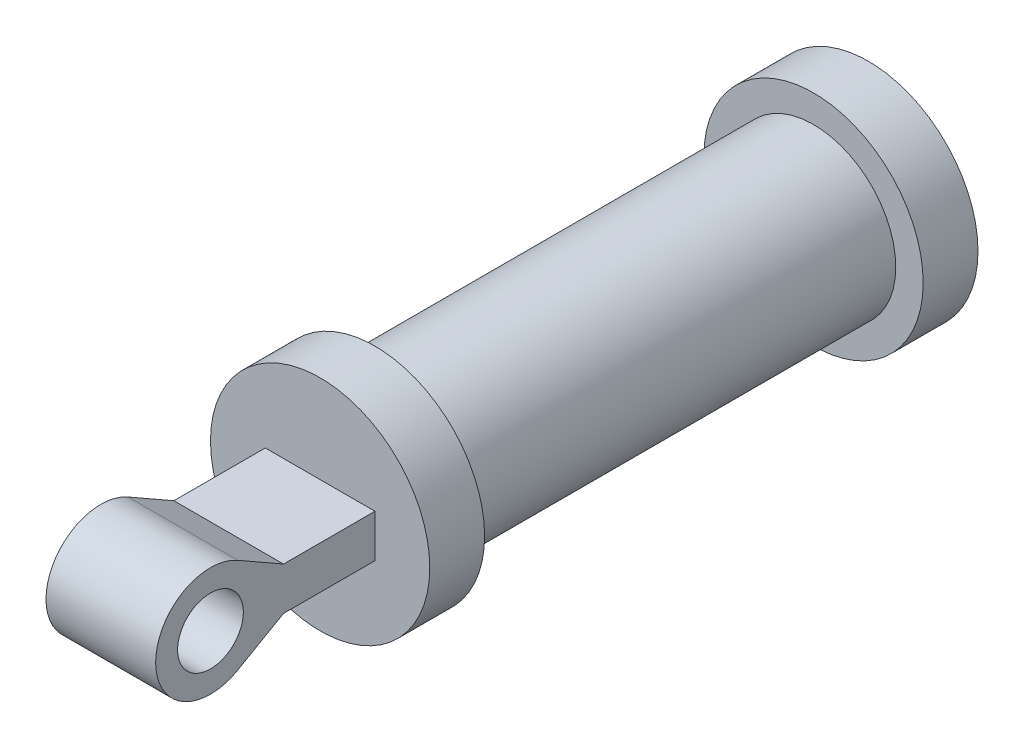
ISO-10303-21;
HEADER;
FILE_DESCRIPTION(('STEP AP214'),'2;1');
FILE_NAME('part.step','',(''),(''),'','','');
FILE_SCHEMA(('AUTOMOTIVE_DESIGN { 1 0 10303 214 1 1 1 1 }'));
ENDSEC;
DATA;
#1=APPLICATION_CONTEXT('core data for automotive mechanical design processes');
#2=APPLICATION_PROTOCOL_DEFINITION('international standard','automotive_design',2000,#1);
#3=PRODUCT_CONTEXT('',#1,'mechanical');
#4=PRODUCT('Part','Part','',(#3));
#5=PRODUCT_RELATED_PRODUCT_CATEGORY('part','',(#4));
#6=PRODUCT_DEFINITION_FORMATION('','',#4);
#7=PRODUCT_DEFINITION_CONTEXT('part definition',#1,'design');
#8=PRODUCT_DEFINITION('design','',#6,#7);
#9=PRODUCT_DEFINITION_SHAPE('','',#8);
#10=(LENGTH_UNIT() NAMED_UNIT(*) SI_UNIT(.MILLI.,.METRE.));
#11=(NAMED_UNIT(*) PLANE_ANGLE_UNIT() SI_UNIT($,.RADIAN.));
#12=(NAMED_UNIT(*) SI_UNIT($,.STERADIAN.) SOLID_ANGLE_UNIT());
#13=UNCERTAINTY_MEASURE_WITH_UNIT(LENGTH_MEASURE(1.E-05),#10,'distance_accuracy_value','');
#14=(GEOMETRIC_REPRESENTATION_CONTEXT(3) GLOBAL_UNCERTAINTY_ASSIGNED_CONTEXT((#13)) GLOBAL_UNIT_ASSIGNED_CONTEXT((#10,
#11,#12)) REPRESENTATION_CONTEXT('',''));
#15=CARTESIAN_POINT('',(0.,0.,0.));
#16=DIRECTION('',(0.,0.,1.));
#17=DIRECTION('',(1.,0.,0.));
#18=AXIS2_PLACEMENT_3D('',#15,#16,#17);
#19=CARTESIAN_POINT('',(-100.,-236.576375585564,-127.131491420684));
#20=DIRECTION('',(0.,0.86825917602219,-0.496110877983205));
#21=DIRECTION('',(0.,0.496110877983205,0.86825917602219));
#22=AXIS2_PLACEMENT_3D('',#19,#20,#21);
#23=PLANE('',#22);
#24=DIRECTION('',(1.,0.,0.));
#25=VECTOR('',#24,1.);
#26=CARTESIAN_POINT('',(-100.,43.4129588011095,362.886606464693));
#27=LINE('',#26,#25);
#28=CARTESIAN_POINT('',(-50.,43.4129588011095,362.886606464693));
#29=VERTEX_POINT('',#28);
#30=CARTESIAN_POINT('',(50.,43.4129588011095,362.886606464693));
#31=VERTEX_POINT('',#30);
#32=EDGE_CURVE('E150',#29,#31,#27,.T.);
#33=ORIENTED_EDGE('',*,*,#32,.T.);
#34=DIRECTION('',(0.,-0.496110877983205,-0.86825917602219));
#35=VECTOR('',#34,1.);
#36=CARTESIAN_POINT('',(50.,-236.576375585564,-127.131491420684));
#37=LINE('',#36,#35);
#38=CARTESIAN_POINT('',(50.,19.5216947713146,321.073757480275));
#39=VERTEX_POINT('',#38);
#40=EDGE_CURVE('E90',#31,#39,#37,.T.);
#41=ORIENTED_EDGE('',*,*,#40,.T.);
#42=DIRECTION('',(1.,0.,0.));
#43=VECTOR('',#42,1.);
#44=CARTESIAN_POINT('',(-100.,19.5216947713145,321.073757480275));
#45=LINE('',#44,#43);
#46=CARTESIAN_POINT('',(-50.,19.5216947713145,321.073757480275));
#47=VERTEX_POINT('',#46);
#48=EDGE_CURVE('E133',#47,#39,#45,.T.);
#49=ORIENTED_EDGE('',*,*,#48,.F.);
#50=DIRECTION('',(0.,-0.496110877983205,-0.86825917602219));
#51=VECTOR('',#50,1.);
#52=CARTESIAN_POINT('',(-50.,-236.576375585564,-127.131491420684));
#53=LINE('',#52,#51);
#54=EDGE_CURVE('E141',#29,#47,#53,.T.);
#55=ORIENTED_EDGE('',*,*,#54,.F.);
#56=EDGE_LOOP('',(#33,#41,#49,#55));
#57=FACE_BOUND('',#56,.T.);
#58=ADVANCED_FACE('F73',(#57),#23,.T.);
#59=CARTESIAN_POINT('',(-100.,0.,387.692150363853));
#60=DIRECTION('',(1.,0.,0.));
#61=DIRECTION('',(0.,0.,-1.));
#62=AXIS2_PLACEMENT_3D('',#59,#60,#61);
#63=CYLINDRICAL_SURFACE('',#62,50.);
#64=DIRECTION('',(1.,0.,0.));
#65=VECTOR('',#64,1.);
#66=CARTESIAN_POINT('',(-100.,-43.4129588011095,362.886606464692));
#67=LINE('',#66,#65);
#68=CARTESIAN_POINT('',(-50.,-43.4129588011095,362.886606464692));
#69=VERTEX_POINT('',#68);
#70=CARTESIAN_POINT('',(50.,-43.4129588011095,362.886606464692));
#71=VERTEX_POINT('',#70);
#72=EDGE_CURVE('E154',#69,#71,#67,.T.);
#73=ORIENTED_EDGE('',*,*,#72,.T.);
#74=CARTESIAN_POINT('',(50.,0.,387.692150363853));
#75=DIRECTION('',(1.,0.,0.));
#76=DIRECTION('',(0.,0.,-1.));
#77=AXIS2_PLACEMENT_3D('',#74,#75,#76);
#78=CIRCLE('',#77,50.);
#79=EDGE_CURVE('E94',#71,#31,#78,.F.);
#80=ORIENTED_EDGE('',*,*,#79,.T.);
#81=ORIENTED_EDGE('',*,*,#32,.F.);
#82=CARTESIAN_POINT('',(-50.,0.,387.692150363853));
#83=DIRECTION('',(1.,0.,0.));
#84=DIRECTION('',(0.,0.,-1.));
#85=AXIS2_PLACEMENT_3D('',#82,#83,#84);
#86=CIRCLE('',#85,50.);
#87=EDGE_CURVE('E145',#69,#29,#86,.F.);
#88=ORIENTED_EDGE('',*,*,#87,.F.);
#89=EDGE_LOOP('',(#73,#80,#81,#88));
#90=FACE_BOUND('',#89,.T.);
#91=ADVANCED_FACE('F233',(#90),#63,.T.);
#92=CARTESIAN_POINT('',(-100.,236.576375585563,-127.131491420684));
#93=DIRECTION('',(0.,0.868259176022191,0.496110877983205));
#94=DIRECTION('',(0.,-0.496110877983205,0.868259176022191));
#95=AXIS2_PLACEMENT_3D('',#92,#93,#94);
#96=PLANE('',#95);
#97=DIRECTION('',(0.,0.496110877983205,-0.868259176022191));
#98=VECTOR('',#97,1.);
#99=CARTESIAN_POINT('',(50.,236.576375585563,-127.131491420684));
#100=LINE('',#99,#98);
#101=CARTESIAN_POINT('',(50.,-19.5216947713145,321.073757480275));
#102=VERTEX_POINT('',#101);
#103=EDGE_CURVE('E209',#71,#102,#100,.T.);
#104=ORIENTED_EDGE('',*,*,#103,.F.);
#105=ORIENTED_EDGE('',*,*,#72,.F.);
#106=DIRECTION('',(0.,0.496110877983205,-0.868259176022191));
#107=VECTOR('',#106,1.);
#108=CARTESIAN_POINT('',(-50.,236.576375585563,-127.131491420684));
#109=LINE('',#108,#107);
#110=CARTESIAN_POINT('',(-50.,-19.5216947713145,321.073757480275));
#111=VERTEX_POINT('',#110);
#112=EDGE_CURVE('E193',#69,#111,#109,.T.);
#113=ORIENTED_EDGE('',*,*,#112,.T.);
#114=DIRECTION('',(1.,0.,0.));
#115=VECTOR('',#114,1.);
#116=CARTESIAN_POINT('',(-100.,-19.5216947713145,321.073757480275));
#117=LINE('',#116,#115);
#118=EDGE_CURVE('E216',#111,#102,#117,.T.);
#119=ORIENTED_EDGE('',*,*,#118,.T.);
#120=EDGE_LOOP('',(#104,#105,#113,#119));
#121=FACE_BOUND('',#120,.T.);
#122=ADVANCED_FACE('F231',(#121),#96,.F.);
#123=CARTESIAN_POINT('',(0.,0.,-212.307849636147));
#124=DIRECTION('',(0.,0.,-1.));
#125=DIRECTION('',(-1.,0.,0.));
#126=AXIS2_PLACEMENT_3D('',#123,#124,#125);
#127=CYLINDRICAL_SURFACE('',#126,100.);
#128=CARTESIAN_POINT('',(0.,0.,-212.307849636147));
#129=DIRECTION('',(0.,0.,1.));
#130=DIRECTION('',(1.,0.,0.));
#131=AXIS2_PLACEMENT_3D('',#128,#129,#130);
#132=CIRCLE('',#131,100.);
#133=CARTESIAN_POINT('',(100.,0.,-212.307849636147));
#134=VERTEX_POINT('',#133);
#135=EDGE_CURVE('E82',#134,#134,#132,.T.);
#136=ORIENTED_EDGE('',*,*,#135,.F.);
#137=EDGE_LOOP('',(#136));
#138=FACE_BOUND('',#137,.T.);
#139=CARTESIAN_POINT('',(0.,0.,-262.307849636147));
#140=DIRECTION('',(0.,0.,1.));
#141=DIRECTION('',(1.,0.,0.));
#142=AXIS2_PLACEMENT_3D('',#139,#140,#141);
#143=CIRCLE('',#142,100.);
#144=CARTESIAN_POINT('',(100.,0.,-262.307849636147));
#145=VERTEX_POINT('',#144);
#146=EDGE_CURVE('E187',#145,#145,#143,.T.);
#147=ORIENTED_EDGE('',*,*,#146,.T.);
#148=EDGE_LOOP('',(#147));
#149=FACE_BOUND('',#148,.T.);
#150=ADVANCED_FACE('F75',(#138,#149),#127,.T.);
#151=CARTESIAN_POINT('',(0.,0.,-212.307849636147));
#152=DIRECTION('',(0.,0.,1.));
#153=DIRECTION('',(1.,0.,0.));
#154=AXIS2_PLACEMENT_3D('',#151,#152,#153);
#155=PLANE('',#154);
#156=CARTESIAN_POINT('',(0.,0.,-212.307849636147));
#157=DIRECTION('',(0.,0.,1.));
#158=DIRECTION('',(1.,0.,0.));
#159=AXIS2_PLACEMENT_3D('',#156,#157,#158);
#160=CIRCLE('',#159,75.);
#161=CARTESIAN_POINT('',(75.,0.,-212.307849636147));
#162=VERTEX_POINT('',#161);
#163=EDGE_CURVE('E12',#162,#162,#160,.T.);
#164=ORIENTED_EDGE('',*,*,#163,.F.);
#165=EDGE_LOOP('',(#164));
#166=FACE_BOUND('',#165,.T.);
#167=ORIENTED_EDGE('',*,*,#135,.T.);
#168=EDGE_LOOP('',(#167));
#169=FACE_BOUND('',#168,.T.);
#170=ADVANCED_FACE('F284',(#166,#169),#155,.T.);
#171=CARTESIAN_POINT('',(0.,0.,-262.307849636147));
#172=DIRECTION('',(0.,0.,1.));
#173=DIRECTION('',(1.,0.,0.));
#174=AXIS2_PLACEMENT_3D('',#171,#172,#173);
#175=PLANE('',#174);
#176=CARTESIAN_POINT('',(0.,0.,-262.307849636147));
#177=DIRECTION('',(0.,0.,1.));
#178=DIRECTION('',(1.,0.,0.));
#179=AXIS2_PLACEMENT_3D('',#176,#177,#178);
#180=CIRCLE('',#179,24.);
#181=CARTESIAN_POINT('',(24.,0.,-262.307849636147));
#182=VERTEX_POINT('',#181);
#183=EDGE_CURVE('E184',#182,#182,#180,.T.);
#184=ORIENTED_EDGE('',*,*,#183,.T.);
#185=EDGE_LOOP('',(#184));
#186=FACE_BOUND('',#185,.T.);
#187=ORIENTED_EDGE('',*,*,#146,.F.);
#188=EDGE_LOOP('',(#187));
#189=FACE_BOUND('',#188,.T.);
#190=ADVANCED_FACE('F282',(#186,#189),#175,.F.);
#191=CARTESIAN_POINT('',(0.,0.,-212.307849636147));
#192=DIRECTION('',(0.,0.,1.));
#193=DIRECTION('',(1.,0.,0.));
#194=AXIS2_PLACEMENT_3D('',#191,#192,#193);
#195=CYLINDRICAL_SURFACE('',#194,24.);
#196=CARTESIAN_POINT('',(0.,0.,-238.307849636147));
#197=DIRECTION('',(0.,0.,1.));
#198=DIRECTION('',(1.,0.,0.));
#199=AXIS2_PLACEMENT_3D('',#196,#197,#198);
#200=CIRCLE('',#199,24.);
#201=CARTESIAN_POINT('',(24.,0.,-238.307849636147));
#202=VERTEX_POINT('',#201);
#203=EDGE_CURVE('E181',#202,#202,#200,.T.);
#204=ORIENTED_EDGE('',*,*,#203,.T.);
#205=EDGE_LOOP('',(#204));
#206=FACE_BOUND('',#205,.T.);
#207=ORIENTED_EDGE('',*,*,#183,.F.);
#208=EDGE_LOOP('',(#207));
#209=FACE_BOUND('',#208,.T.);
#210=ADVANCED_FACE('F278',(#206,#209),#195,.F.);
#211=CARTESIAN_POINT('',(24.,0.,-238.307849636147));
#212=DIRECTION('',(0.,0.,-1.));
#213=DIRECTION('',(-1.,0.,0.));
#214=AXIS2_PLACEMENT_3D('',#211,#212,#213);
#215=PLANE('',#214);
#216=ORIENTED_EDGE('',*,*,#203,.F.);
#217=EDGE_LOOP('',(#216));
#218=FACE_BOUND('',#217,.T.);
#219=CARTESIAN_POINT('',(0.,0.,-238.307849636147));
#220=DIRECTION('',(0.,0.,1.));
#221=DIRECTION('',(1.,0.,0.));
#222=AXIS2_PLACEMENT_3D('',#219,#220,#221);
#223=CIRCLE('',#222,40.);
#224=CARTESIAN_POINT('',(40.,0.,-238.307849636147));
#225=VERTEX_POINT('',#224);
#226=EDGE_CURVE('E178',#225,#225,#223,.T.);
#227=ORIENTED_EDGE('',*,*,#226,.T.);
#228=EDGE_LOOP('',(#227));
#229=FACE_BOUND('',#228,.T.);
#230=ADVANCED_FACE('F274',(#218,#229),#215,.F.);
#231=CARTESIAN_POINT('',(0.,0.,-212.307849636147));
#232=DIRECTION('',(0.,0.,1.));
#233=DIRECTION('',(1.,0.,0.));
#234=AXIS2_PLACEMENT_3D('',#231,#232,#233);
#235=CYLINDRICAL_SURFACE('',#234,40.);
#236=ORIENTED_EDGE('',*,*,#226,.F.);
#237=EDGE_LOOP('',(#236));
#238=FACE_BOUND('',#237,.T.);
#239=CARTESIAN_POINT('',(0.,0.,-212.557849636147));
#240=DIRECTION('',(0.,0.,1.));
#241=DIRECTION('',(1.,0.,0.));
#242=AXIS2_PLACEMENT_3D('',#239,#240,#241);
#243=CIRCLE('',#242,40.);
#244=CARTESIAN_POINT('',(40.,0.,-212.557849636147));
#245=VERTEX_POINT('',#244);
#246=EDGE_CURVE('E175',#245,#245,#243,.T.);
#247=ORIENTED_EDGE('',*,*,#246,.T.);
#248=EDGE_LOOP('',(#247));
#249=FACE_BOUND('',#248,.T.);
#250=ADVANCED_FACE('F270',(#238,#249),#235,.F.);
#251=CARTESIAN_POINT('',(0.,0.,-212.307849636147));
#252=DIRECTION('',(0.,0.,1.));
#253=DIRECTION('',(1.,0.,0.));
#254=AXIS2_PLACEMENT_3D('',#251,#252,#253);
#255=CONICAL_SURFACE('',#254,40.25,0.785398163397448);
#256=ORIENTED_EDGE('',*,*,#246,.F.);
#257=EDGE_LOOP('',(#256));
#258=FACE_BOUND('',#257,.T.);
#259=CARTESIAN_POINT('',(0.,0.,-212.307849636147));
#260=DIRECTION('',(0.,0.,1.));
#261=DIRECTION('',(1.,0.,0.));
#262=AXIS2_PLACEMENT_3D('',#259,#260,#261);
#263=CIRCLE('',#262,40.25);
#264=CARTESIAN_POINT('',(40.25,0.,-212.307849636147));
#265=VERTEX_POINT('',#264);
#266=EDGE_CURVE('E171',#265,#265,#263,.T.);
#267=ORIENTED_EDGE('',*,*,#266,.T.);
#268=EDGE_LOOP('',(#267));
#269=FACE_BOUND('',#268,.T.);
#270=ADVANCED_FACE('F266',(#258,#269),#255,.F.);
#271=CARTESIAN_POINT('',(0.,0.,187.692150363853));
#272=DIRECTION('',(0.,0.,-1.));
#273=DIRECTION('',(-1.,0.,0.));
#274=AXIS2_PLACEMENT_3D('',#271,#272,#273);
#275=CYLINDRICAL_SURFACE('',#274,75.);
#276=CARTESIAN_POINT('',(0.,0.,187.692150363853));
#277=DIRECTION('',(0.,0.,1.));
#278=DIRECTION('',(1.,0.,0.));
#279=AXIS2_PLACEMENT_3D('',#276,#277,#278);
#280=CIRCLE('',#279,75.);
#281=CARTESIAN_POINT('',(75.,0.,187.692150363853));
#282=VERTEX_POINT('',#281);
#283=EDGE_CURVE('E167',#282,#282,#280,.T.);
#284=ORIENTED_EDGE('',*,*,#283,.F.);
#285=EDGE_LOOP('',(#284));
#286=FACE_BOUND('',#285,.T.);
#287=ORIENTED_EDGE('',*,*,#163,.T.);
#288=EDGE_LOOP('',(#287));
#289=FACE_BOUND('',#288,.T.);
#290=ADVANCED_FACE('F262',(#286,#289),#275,.T.);
#291=CARTESIAN_POINT('',(0.,0.,-212.307849636147));
#292=DIRECTION('',(0.,0.,1.));
#293=DIRECTION('',(1.,0.,0.));
#294=AXIS2_PLACEMENT_3D('',#291,#292,#293);
#295=PLANE('',#294);
#296=CARTESIAN_POINT('',(0.,0.,-212.307849636147));
#297=DIRECTION('',(0.,0.,1.));
#298=DIRECTION('',(1.,0.,0.));
#299=AXIS2_PLACEMENT_3D('',#296,#297,#298);
#300=CIRCLE('',#299,40.);
#301=CARTESIAN_POINT('',(40.,0.,-212.307849636147));
#302=VERTEX_POINT('',#301);
#303=EDGE_CURVE('E164',#302,#302,#300,.T.);
#304=ORIENTED_EDGE('',*,*,#303,.T.);
#305=EDGE_LOOP('',(#304));
#306=FACE_BOUND('',#305,.T.);
#307=ORIENTED_EDGE('',*,*,#266,.F.);
#308=EDGE_LOOP('',(#307));
#309=FACE_BOUND('',#308,.T.);
#310=ADVANCED_FACE('F258',(#306,#309),#295,.F.);
#311=CARTESIAN_POINT('',(0.,0.,-212.307849636147));
#312=DIRECTION('',(0.,0.,1.));
#313=DIRECTION('',(1.,0.,0.));
#314=AXIS2_PLACEMENT_3D('',#311,#312,#313);
#315=CYLINDRICAL_SURFACE('',#314,40.);
#316=ORIENTED_EDGE('',*,*,#303,.F.);
#317=EDGE_LOOP('',(#316));
#318=FACE_BOUND('',#317,.T.);
#319=CARTESIAN_POINT('',(0.,0.,187.692150363853));
#320=DIRECTION('',(0.,0.,1.));
#321=DIRECTION('',(1.,0.,0.));
#322=AXIS2_PLACEMENT_3D('',#319,#320,#321);
#323=CIRCLE('',#322,40.);
#324=CARTESIAN_POINT('',(40.,0.,187.692150363853));
#325=VERTEX_POINT('',#324);
#326=EDGE_CURVE('E161',#325,#325,#323,.T.);
#327=ORIENTED_EDGE('',*,*,#326,.T.);
#328=EDGE_LOOP('',(#327));
#329=FACE_BOUND('',#328,.T.);
#330=ADVANCED_FACE('F250',(#318,#329),#315,.F.);
#331=CARTESIAN_POINT('',(0.,0.,187.692150363853));
#332=DIRECTION('',(0.,0.,1.));
#333=DIRECTION('',(1.,0.,0.));
#334=AXIS2_PLACEMENT_3D('',#331,#332,#333);
#335=PLANE('',#334);
#336=ORIENTED_EDGE('',*,*,#283,.T.);
#337=EDGE_LOOP('',(#336));
#338=FACE_BOUND('',#337,.T.);
#339=CARTESIAN_POINT('',(0.,0.,187.692150363853));
#340=DIRECTION('',(0.,0.,1.));
#341=DIRECTION('',(1.,0.,0.));
#342=AXIS2_PLACEMENT_3D('',#339,#340,#341);
#343=CIRCLE('',#342,100.);
#344=CARTESIAN_POINT('',(100.,0.,187.692150363853));
#345=VERTEX_POINT('',#344);
#346=EDGE_CURVE('E152',#345,#345,#343,.T.);
#347=ORIENTED_EDGE('',*,*,#346,.F.);
#348=EDGE_LOOP('',(#347));
#349=FACE_BOUND('',#348,.T.);
#350=ADVANCED_FACE('F247',(#338,#349),#335,.F.);
#351=CARTESIAN_POINT('',(0.,0.,237.692150363853));
#352=DIRECTION('',(0.,0.,1.));
#353=DIRECTION('',(1.,0.,0.));
#354=AXIS2_PLACEMENT_3D('',#351,#352,#353);
#355=PLANE('',#354);
#356=DIRECTION('',(0.,-1.,0.));
#357=VECTOR('',#356,1.);
#358=CARTESIAN_POINT('',(-50.,19.5216947713145,237.692150363853));
#359=LINE('',#358,#357);
#360=CARTESIAN_POINT('',(-50.,19.5216947713145,237.692150363853));
#361=VERTEX_POINT('',#360);
#362=CARTESIAN_POINT('',(-50.,-19.5216947713145,237.692150363853));
#363=VERTEX_POINT('',#362);
#364=EDGE_CURVE('E137',#361,#363,#359,.T.);
#365=ORIENTED_EDGE('',*,*,#364,.F.);
#366=DIRECTION('',(1.,0.,0.));
#367=VECTOR('',#366,1.);
#368=CARTESIAN_POINT('',(-100.,19.5216947713145,237.692150363853));
#369=LINE('',#368,#367);
#370=CARTESIAN_POINT('',(50.,19.5216947713145,237.692150363853));
#371=VERTEX_POINT('',#370);
#372=EDGE_CURVE('E135',#361,#371,#369,.T.);
#373=ORIENTED_EDGE('',*,*,#372,.T.);
#374=DIRECTION('',(0.,1.,0.));
#375=VECTOR('',#374,1.);
#376=CARTESIAN_POINT('',(50.,19.5216947713145,237.692150363853));
#377=LINE('',#376,#375);
#378=CARTESIAN_POINT('',(50.,-19.5216947713145,237.692150363853));
#379=VERTEX_POINT('',#378);
#380=EDGE_CURVE('E202',#379,#371,#377,.T.);
#381=ORIENTED_EDGE('',*,*,#380,.F.);
#382=DIRECTION('',(1.,0.,0.));
#383=VECTOR('',#382,1.);
#384=CARTESIAN_POINT('',(-100.,-19.5216947713145,237.692150363853));
#385=LINE('',#384,#383);
#386=EDGE_CURVE('E213',#363,#379,#385,.T.);
#387=ORIENTED_EDGE('',*,*,#386,.F.);
#388=EDGE_LOOP('',(#365,#373,#381,#387));
#389=FACE_BOUND('',#388,.T.);
#390=CARTESIAN_POINT('',(0.,0.,237.692150363853));
#391=DIRECTION('',(0.,0.,1.));
#392=DIRECTION('',(1.,0.,0.));
#393=AXIS2_PLACEMENT_3D('',#390,#391,#392);
#394=CIRCLE('',#393,100.);
#395=CARTESIAN_POINT('',(100.,0.,237.692150363853));
#396=VERTEX_POINT('',#395);
#397=EDGE_CURVE('E158',#396,#396,#394,.T.);
#398=ORIENTED_EDGE('',*,*,#397,.T.);
#399=EDGE_LOOP('',(#398));
#400=FACE_BOUND('',#399,.T.);
#401=ADVANCED_FACE('F225',(#389,#400),#355,.T.);
#402=CARTESIAN_POINT('',(0.,0.,237.692150363853));
#403=DIRECTION('',(0.,0.,-1.));
#404=DIRECTION('',(-1.,0.,0.));
#405=AXIS2_PLACEMENT_3D('',#402,#403,#404);
#406=CYLINDRICAL_SURFACE('',#405,100.);
#407=ORIENTED_EDGE('',*,*,#397,.F.);
#408=EDGE_LOOP('',(#407));
#409=FACE_BOUND('',#408,.T.);
#410=ORIENTED_EDGE('',*,*,#346,.T.);
#411=EDGE_LOOP('',(#410));
#412=FACE_BOUND('',#411,.T.);
#413=ADVANCED_FACE('F246',(#409,#412),#406,.T.);
#414=ORIENTED_EDGE('',*,*,#326,.F.);
#415=EDGE_LOOP('',(#414));
#416=FACE_BOUND('',#415,.T.);
#417=ADVANCED_FACE('F252',(#416),#335,.F.);
#418=CARTESIAN_POINT('',(-100.,19.5216947713146,-262.307849636147));
#419=DIRECTION('',(0.,1.,0.));
#420=DIRECTION('',(0.,0.,1.));
#421=AXIS2_PLACEMENT_3D('',#418,#419,#420);
#422=PLANE('',#421);
#423=DIRECTION('',(0.,0.,1.));
#424=VECTOR('',#423,1.);
#425=CARTESIAN_POINT('',(-50.,19.5216947713145,198.467407083135));
#426=LINE('',#425,#424);
#427=EDGE_CURVE('E128',#361,#47,#426,.T.);
#428=ORIENTED_EDGE('',*,*,#427,.T.);
#429=ORIENTED_EDGE('',*,*,#48,.T.);
#430=DIRECTION('',(0.,0.,1.));
#431=VECTOR('',#430,1.);
#432=CARTESIAN_POINT('',(50.,19.5216947713145,198.467407083135));
#433=LINE('',#432,#431);
#434=EDGE_CURVE('E206',#371,#39,#433,.T.);
#435=ORIENTED_EDGE('',*,*,#434,.F.);
#436=ORIENTED_EDGE('',*,*,#372,.F.);
#437=EDGE_LOOP('',(#428,#429,#435,#436));
#438=FACE_BOUND('',#437,.T.);
#439=ADVANCED_FACE('F130',(#438),#422,.T.);
#440=CARTESIAN_POINT('',(-100.,-19.5216947713145,-262.307849636147));
#441=DIRECTION('',(0.,-1.,0.));
#442=DIRECTION('',(0.,0.,-1.));
#443=AXIS2_PLACEMENT_3D('',#440,#441,#442);
#444=PLANE('',#443);
#445=DIRECTION('',(0.,0.,1.));
#446=VECTOR('',#445,1.);
#447=CARTESIAN_POINT('',(-50.,-19.5216947713145,198.467407083135));
#448=LINE('',#447,#446);
#449=EDGE_CURVE('E138',#363,#111,#448,.T.);
#450=ORIENTED_EDGE('',*,*,#449,.F.);
#451=ORIENTED_EDGE('',*,*,#386,.T.);
#452=DIRECTION('',(0.,0.,1.));
#453=VECTOR('',#452,1.);
#454=CARTESIAN_POINT('',(50.,-19.5216947713145,198.467407083135));
#455=LINE('',#454,#453);
#456=EDGE_CURVE('E204',#379,#102,#455,.T.);
#457=ORIENTED_EDGE('',*,*,#456,.T.);
#458=ORIENTED_EDGE('',*,*,#118,.F.);
#459=EDGE_LOOP('',(#450,#451,#457,#458));
#460=FACE_BOUND('',#459,.T.);
#461=ADVANCED_FACE('F221',(#460),#444,.T.);
#462=CARTESIAN_POINT('',(-50.,-80.4783052286854,-262.307849636147));
#463=DIRECTION('',(1.,0.,0.));
#464=DIRECTION('',(0.,0.,-1.));
#465=AXIS2_PLACEMENT_3D('',#462,#463,#464);
#466=PLANE('',#465);
#467=ORIENTED_EDGE('',*,*,#54,.T.);
#468=ORIENTED_EDGE('',*,*,#427,.F.);
#469=ORIENTED_EDGE('',*,*,#364,.T.);
#470=ORIENTED_EDGE('',*,*,#449,.T.);
#471=ORIENTED_EDGE('',*,*,#112,.F.);
#472=ORIENTED_EDGE('',*,*,#87,.T.);
#473=EDGE_LOOP('',(#467,#468,#469,#470,#471,#472));
#474=FACE_BOUND('',#473,.T.);
#475=CARTESIAN_POINT('',(-50.,0.,387.692150363853));
#476=DIRECTION('',(1.,0.,0.));
#477=DIRECTION('',(0.,0.,-1.));
#478=AXIS2_PLACEMENT_3D('',#475,#476,#477);
#479=CIRCLE('',#478,30.);
#480=CARTESIAN_POINT('',(-50.,0.,357.692150363853));
#481=VERTEX_POINT('',#480);
#482=EDGE_CURVE('E191',#481,#481,#479,.F.);
#483=ORIENTED_EDGE('',*,*,#482,.F.);
#484=EDGE_LOOP('',(#483));
#485=FACE_BOUND('',#484,.T.);
#486=ADVANCED_FACE('F142',(#474,#485),#466,.F.);
#487=CARTESIAN_POINT('',(50.,-80.4783052286854,-262.307849636147));
#488=DIRECTION('',(1.,0.,0.));
#489=DIRECTION('',(0.,0.,-1.));
#490=AXIS2_PLACEMENT_3D('',#487,#488,#489);
#491=PLANE('',#490);
#492=ORIENTED_EDGE('',*,*,#79,.F.);
#493=ORIENTED_EDGE('',*,*,#103,.T.);
#494=ORIENTED_EDGE('',*,*,#456,.F.);
#495=ORIENTED_EDGE('',*,*,#380,.T.);
#496=ORIENTED_EDGE('',*,*,#434,.T.);
#497=ORIENTED_EDGE('',*,*,#40,.F.);
#498=EDGE_LOOP('',(#492,#493,#494,#495,#496,#497));
#499=FACE_BOUND('',#498,.T.);
#500=CARTESIAN_POINT('',(50.,0.,387.692150363853));
#501=DIRECTION('',(1.,0.,0.));
#502=DIRECTION('',(0.,0.,-1.));
#503=AXIS2_PLACEMENT_3D('',#500,#501,#502);
#504=CIRCLE('',#503,30.);
#505=CARTESIAN_POINT('',(50.,0.,357.692150363853));
#506=VERTEX_POINT('',#505);
#507=EDGE_CURVE('E77',#506,#506,#504,.F.);
#508=ORIENTED_EDGE('',*,*,#507,.T.);
#509=EDGE_LOOP('',(#508));
#510=FACE_BOUND('',#509,.T.);
#511=ADVANCED_FACE('F227',(#499,#510),#491,.T.);
#512=CARTESIAN_POINT('',(-100.,0.,387.692150363853));
#513=DIRECTION('',(1.,0.,0.));
#514=DIRECTION('',(0.,0.,-1.));
#515=AXIS2_PLACEMENT_3D('',#512,#513,#514);
#516=CYLINDRICAL_SURFACE('',#515,30.);
#517=ORIENTED_EDGE('',*,*,#482,.T.);
#518=EDGE_LOOP('',(#517));
#519=FACE_BOUND('',#518,.T.);
#520=ORIENTED_EDGE('',*,*,#507,.F.);
#521=EDGE_LOOP('',(#520));
#522=FACE_BOUND('',#521,.T.);
#523=ADVANCED_FACE('F417',(#519,#522),#516,.F.);
#524=CLOSED_SHELL('',(#58,#91,#122,#150,#170,#190,#210,#230,#250,#270,#290,#310,#330,#350,#401,
#413,#417,#439,#461,#486,#511,#523));
#525=MANIFOLD_SOLID_BREP('B2',#524);
#526=ADVANCED_BREP_SHAPE_REPRESENTATION('',(#18,#525),#14);
#527=SHAPE_DEFINITION_REPRESENTATION(#9,#526);
ENDSEC;
END-ISO-10303-21;
